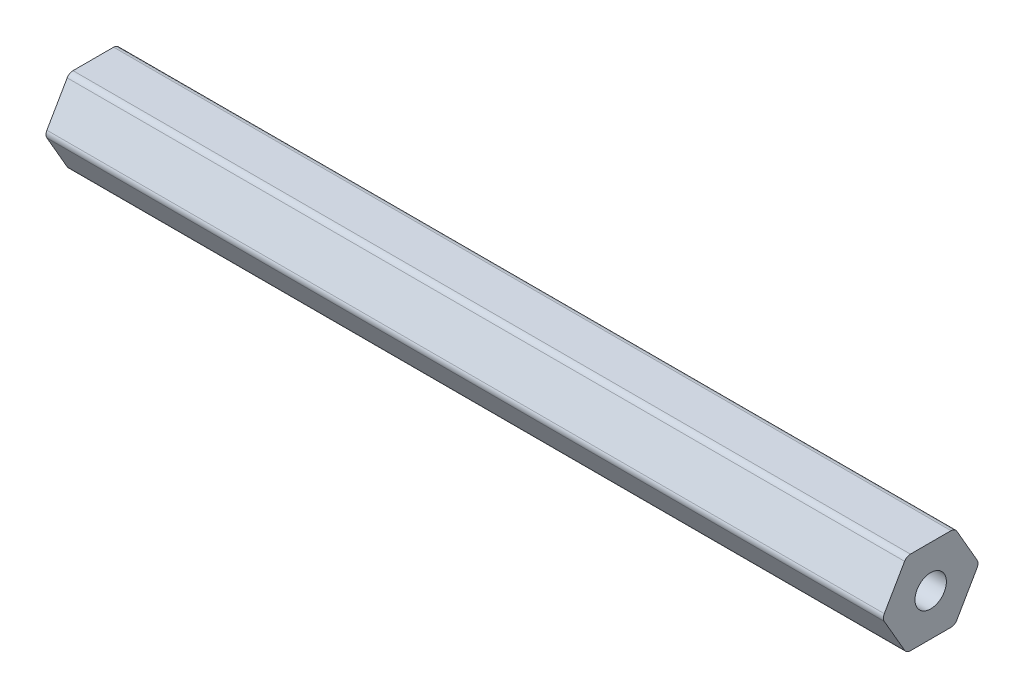
ISO-10303-21;
HEADER;
FILE_DESCRIPTION(('STEP AP214'),'2;1');
FILE_NAME('part.step','',(''),(''),'','','');
FILE_SCHEMA(('AUTOMOTIVE_DESIGN { 1 0 10303 214 1 1 1 1 }'));
ENDSEC;
DATA;
#1=APPLICATION_CONTEXT('core data for automotive mechanical design processes');
#2=APPLICATION_PROTOCOL_DEFINITION('international standard','automotive_design',2000,#1);
#3=PRODUCT_CONTEXT('',#1,'mechanical');
#4=PRODUCT('Part','Part','',(#3));
#5=PRODUCT_RELATED_PRODUCT_CATEGORY('part','',(#4));
#6=PRODUCT_DEFINITION_FORMATION('','',#4);
#7=PRODUCT_DEFINITION_CONTEXT('part definition',#1,'design');
#8=PRODUCT_DEFINITION('design','',#6,#7);
#9=PRODUCT_DEFINITION_SHAPE('','',#8);
#10=(LENGTH_UNIT() NAMED_UNIT(*) SI_UNIT(.MILLI.,.METRE.));
#11=(NAMED_UNIT(*) PLANE_ANGLE_UNIT() SI_UNIT($,.RADIAN.));
#12=(NAMED_UNIT(*) SI_UNIT($,.STERADIAN.) SOLID_ANGLE_UNIT());
#13=UNCERTAINTY_MEASURE_WITH_UNIT(LENGTH_MEASURE(1.E-05),#10,'distance_accuracy_value','');
#14=(GEOMETRIC_REPRESENTATION_CONTEXT(3) GLOBAL_UNCERTAINTY_ASSIGNED_CONTEXT((#13)) GLOBAL_UNIT_ASSIGNED_CONTEXT((#10,
#11,#12)) REPRESENTATION_CONTEXT('',''));
#15=CARTESIAN_POINT('',(0.,0.,0.));
#16=DIRECTION('',(0.,0.,1.));
#17=DIRECTION('',(1.,0.,0.));
#18=AXIS2_PLACEMENT_3D('',#15,#16,#17);
#19=CARTESIAN_POINT('',(127.,5.334,-3.07958633585748));
#20=DIRECTION('',(-1.,0.,0.));
#21=DIRECTION('',(0.,0.,1.));
#22=AXIS2_PLACEMENT_3D('',#19,#20,#21);
#23=PLANE('',#22);
#24=CARTESIAN_POINT('',(127.,5.334,-3.07958633585748));
#25=DIRECTION('',(1.,0.,0.));
#26=DIRECTION('',(0.,0.,1.));
#27=AXIS2_PLACEMENT_3D('',#24,#25,#26);
#28=CIRCLE('',#27,1.016);
#29=CARTESIAN_POINT('',(127.,5.84199999999999,-3.95946814610247));
#30=VERTEX_POINT('',#29);
#31=CARTESIAN_POINT('',(127.,6.34999999999999,-3.07958633585748));
#32=VERTEX_POINT('',#31);
#33=EDGE_CURVE('E206',#30,#32,#28,.T.);
#34=ORIENTED_EDGE('',*,*,#33,.T.);
#35=DIRECTION('',(0.,0.,1.));
#36=VECTOR('',#35,1.);
#37=CARTESIAN_POINT('',(127.,6.34999999999999,-3.07958633585748));
#38=LINE('',#37,#36);
#39=CARTESIAN_POINT('',(127.,6.35000000000001,3.07958633585745));
#40=VERTEX_POINT('',#39);
#41=EDGE_CURVE('E118',#32,#40,#38,.T.);
#42=ORIENTED_EDGE('',*,*,#41,.T.);
#43=CARTESIAN_POINT('',(127.,5.33400000000001,3.07958633585745));
#44=DIRECTION('',(1.,0.,0.));
#45=DIRECTION('',(0.,0.,1.));
#46=AXIS2_PLACEMENT_3D('',#43,#44,#45);
#47=CIRCLE('',#46,1.016);
#48=CARTESIAN_POINT('',(127.,5.84200000000001,3.95946814610244));
#49=VERTEX_POINT('',#48);
#50=EDGE_CURVE('E243',#40,#49,#47,.T.);
#51=ORIENTED_EDGE('',*,*,#50,.T.);
#52=DIRECTION('',(0.,-0.866025403784437,0.500000000000003));
#53=VECTOR('',#52,1.);
#54=CARTESIAN_POINT('',(127.,5.84200000000001,3.95946814610244));
#55=LINE('',#54,#53);
#56=CARTESIAN_POINT('',(127.,0.508000000000022,7.03905448195992));
#57=VERTEX_POINT('',#56);
#58=EDGE_CURVE('E263',#49,#57,#55,.T.);
#59=ORIENTED_EDGE('',*,*,#58,.T.);
#60=CARTESIAN_POINT('',(127.,0.,6.15917267171493));
#61=DIRECTION('',(1.,0.,0.));
#62=DIRECTION('',(0.,0.,1.));
#63=AXIS2_PLACEMENT_3D('',#60,#61,#62);
#64=CIRCLE('',#63,1.016);
#65=CARTESIAN_POINT('',(127.,-0.50799999999998,7.03905448195993));
#66=VERTEX_POINT('',#65);
#67=EDGE_CURVE('E259',#57,#66,#64,.T.);
#68=ORIENTED_EDGE('',*,*,#67,.T.);
#69=DIRECTION('',(0.,-0.86602540378444,-0.499999999999998));
#70=VECTOR('',#69,1.);
#71=CARTESIAN_POINT('',(127.,-0.507999999999979,7.03905448195992));
#72=LINE('',#71,#70);
#73=CARTESIAN_POINT('',(127.,-5.84199999999999,3.95946814610247));
#74=VERTEX_POINT('',#73);
#75=EDGE_CURVE('E262',#66,#74,#72,.T.);
#76=ORIENTED_EDGE('',*,*,#75,.T.);
#77=CARTESIAN_POINT('',(127.,-5.334,3.07958633585748));
#78=DIRECTION('',(1.,0.,0.));
#79=DIRECTION('',(0.,0.,1.));
#80=AXIS2_PLACEMENT_3D('',#77,#78,#79);
#81=CIRCLE('',#80,1.016);
#82=CARTESIAN_POINT('',(127.,-6.35,3.07958633585748));
#83=VERTEX_POINT('',#82);
#84=EDGE_CURVE('E267',#74,#83,#81,.T.);
#85=ORIENTED_EDGE('',*,*,#84,.T.);
#86=DIRECTION('',(0.,0.,-1.));
#87=VECTOR('',#86,1.);
#88=CARTESIAN_POINT('',(127.,-6.35,3.07958633585748));
#89=LINE('',#88,#87);
#90=CARTESIAN_POINT('',(127.,-6.35000000000001,-3.07958633585745));
#91=VERTEX_POINT('',#90);
#92=EDGE_CURVE('E274',#83,#91,#89,.T.);
#93=ORIENTED_EDGE('',*,*,#92,.T.);
#94=CARTESIAN_POINT('',(127.,-5.33400000000001,-3.07958633585745));
#95=DIRECTION('',(1.,0.,0.));
#96=DIRECTION('',(0.,0.,1.));
#97=AXIS2_PLACEMENT_3D('',#94,#95,#96);
#98=CIRCLE('',#97,1.016);
#99=CARTESIAN_POINT('',(127.,-5.84200000000001,-3.95946814610244));
#100=VERTEX_POINT('',#99);
#101=EDGE_CURVE('E149',#91,#100,#98,.T.);
#102=ORIENTED_EDGE('',*,*,#101,.T.);
#103=DIRECTION('',(0.,0.866025403784437,-0.500000000000002));
#104=VECTOR('',#103,1.);
#105=CARTESIAN_POINT('',(127.,-5.84200000000001,-3.95946814610244));
#106=LINE('',#105,#104);
#107=CARTESIAN_POINT('',(127.,-0.508000000000019,-7.03905448195992));
#108=VERTEX_POINT('',#107);
#109=EDGE_CURVE('E143',#100,#108,#106,.T.);
#110=ORIENTED_EDGE('',*,*,#109,.T.);
#111=CARTESIAN_POINT('',(127.,0.,-6.15917267171493));
#112=DIRECTION('',(1.,0.,0.));
#113=DIRECTION('',(0.,0.,1.));
#114=AXIS2_PLACEMENT_3D('',#111,#112,#113);
#115=CIRCLE('',#114,1.016);
#116=CARTESIAN_POINT('',(127.,0.507999999999981,-7.03905448195992));
#117=VERTEX_POINT('',#116);
#118=EDGE_CURVE('E147',#108,#117,#115,.T.);
#119=ORIENTED_EDGE('',*,*,#118,.T.);
#120=DIRECTION('',(0.,0.86602540378444,0.499999999999997));
#121=VECTOR('',#120,1.);
#122=CARTESIAN_POINT('',(127.,0.50799999999998,-7.03905448195992));
#123=LINE('',#122,#121);
#124=EDGE_CURVE('E63',#117,#30,#123,.T.);
#125=ORIENTED_EDGE('',*,*,#124,.T.);
#126=EDGE_LOOP('',(#34,#42,#51,#59,#68,#76,#85,#93,#102,#110,#119,#125));
#127=FACE_BOUND('',#126,.T.);
#128=CARTESIAN_POINT('',(127.,0.,0.));
#129=DIRECTION('',(1.,0.,0.));
#130=DIRECTION('',(0.,0.,-1.));
#131=AXIS2_PLACEMENT_3D('',#128,#129,#130);
#132=CIRCLE('',#131,2.38125);
#133=CARTESIAN_POINT('',(127.,0.,-2.38125));
#134=VERTEX_POINT('',#133);
#135=EDGE_CURVE('E176',#134,#134,#132,.T.);
#136=ORIENTED_EDGE('',*,*,#135,.F.);
#137=EDGE_LOOP('',(#136));
#138=FACE_BOUND('',#137,.T.);
#139=ADVANCED_FACE('F45',(#127,#138),#23,.F.);
#140=CARTESIAN_POINT('',(0.,5.334,-3.07958633585748));
#141=DIRECTION('',(-1.,0.,0.));
#142=DIRECTION('',(0.,0.,1.));
#143=AXIS2_PLACEMENT_3D('',#140,#141,#142);
#144=PLANE('',#143);
#145=CARTESIAN_POINT('',(0.,5.334,-3.07958633585748));
#146=DIRECTION('',(1.,0.,0.));
#147=DIRECTION('',(0.,0.,1.));
#148=AXIS2_PLACEMENT_3D('',#145,#146,#147);
#149=CIRCLE('',#148,1.016);
#150=CARTESIAN_POINT('',(0.,5.84199999999999,-3.95946814610247));
#151=VERTEX_POINT('',#150);
#152=CARTESIAN_POINT('',(0.,6.34999999999999,-3.07958633585748));
#153=VERTEX_POINT('',#152);
#154=EDGE_CURVE('E171',#151,#153,#149,.T.);
#155=ORIENTED_EDGE('',*,*,#154,.F.);
#156=DIRECTION('',(0.,0.86602540378444,0.499999999999997));
#157=VECTOR('',#156,1.);
#158=CARTESIAN_POINT('',(0.,0.50799999999998,-7.03905448195992));
#159=LINE('',#158,#157);
#160=CARTESIAN_POINT('',(0.,0.507999999999981,-7.03905448195992));
#161=VERTEX_POINT('',#160);
#162=EDGE_CURVE('E110',#161,#151,#159,.T.);
#163=ORIENTED_EDGE('',*,*,#162,.F.);
#164=CARTESIAN_POINT('',(0.,0.,-6.15917267171493));
#165=DIRECTION('',(1.,0.,0.));
#166=DIRECTION('',(0.,0.,1.));
#167=AXIS2_PLACEMENT_3D('',#164,#165,#166);
#168=CIRCLE('',#167,1.016);
#169=CARTESIAN_POINT('',(0.,-0.508000000000019,-7.03905448195992));
#170=VERTEX_POINT('',#169);
#171=EDGE_CURVE('E104',#170,#161,#168,.T.);
#172=ORIENTED_EDGE('',*,*,#171,.F.);
#173=DIRECTION('',(0.,0.866025403784437,-0.500000000000002));
#174=VECTOR('',#173,1.);
#175=CARTESIAN_POINT('',(0.,-5.84200000000001,-3.95946814610244));
#176=LINE('',#175,#174);
#177=CARTESIAN_POINT('',(0.,-5.84200000000001,-3.95946814610244));
#178=VERTEX_POINT('',#177);
#179=EDGE_CURVE('E158',#178,#170,#176,.T.);
#180=ORIENTED_EDGE('',*,*,#179,.F.);
#181=CARTESIAN_POINT('',(0.,-5.33400000000001,-3.07958633585745));
#182=DIRECTION('',(1.,0.,0.));
#183=DIRECTION('',(0.,0.,1.));
#184=AXIS2_PLACEMENT_3D('',#181,#182,#183);
#185=CIRCLE('',#184,1.016);
#186=CARTESIAN_POINT('',(0.,-6.35000000000001,-3.07958633585745));
#187=VERTEX_POINT('',#186);
#188=EDGE_CURVE('E197',#187,#178,#185,.T.);
#189=ORIENTED_EDGE('',*,*,#188,.F.);
#190=DIRECTION('',(0.,0.,-1.));
#191=VECTOR('',#190,1.);
#192=CARTESIAN_POINT('',(0.,-6.35,3.07958633585748));
#193=LINE('',#192,#191);
#194=CARTESIAN_POINT('',(0.,-6.35,3.07958633585748));
#195=VERTEX_POINT('',#194);
#196=EDGE_CURVE('E194',#195,#187,#193,.T.);
#197=ORIENTED_EDGE('',*,*,#196,.F.);
#198=CARTESIAN_POINT('',(0.,-5.334,3.07958633585748));
#199=DIRECTION('',(1.,0.,0.));
#200=DIRECTION('',(0.,0.,1.));
#201=AXIS2_PLACEMENT_3D('',#198,#199,#200);
#202=CIRCLE('',#201,1.016);
#203=CARTESIAN_POINT('',(0.,-5.84199999999999,3.95946814610247));
#204=VERTEX_POINT('',#203);
#205=EDGE_CURVE('E191',#204,#195,#202,.T.);
#206=ORIENTED_EDGE('',*,*,#205,.F.);
#207=DIRECTION('',(0.,-0.86602540378444,-0.499999999999998));
#208=VECTOR('',#207,1.);
#209=CARTESIAN_POINT('',(0.,-0.507999999999979,7.03905448195992));
#210=LINE('',#209,#208);
#211=CARTESIAN_POINT('',(0.,-0.50799999999998,7.03905448195993));
#212=VERTEX_POINT('',#211);
#213=EDGE_CURVE('E188',#212,#204,#210,.T.);
#214=ORIENTED_EDGE('',*,*,#213,.F.);
#215=CARTESIAN_POINT('',(0.,0.,6.15917267171493));
#216=DIRECTION('',(1.,0.,0.));
#217=DIRECTION('',(0.,0.,1.));
#218=AXIS2_PLACEMENT_3D('',#215,#216,#217);
#219=CIRCLE('',#218,1.016);
#220=CARTESIAN_POINT('',(0.,0.508000000000022,7.03905448195992));
#221=VERTEX_POINT('',#220);
#222=EDGE_CURVE('E185',#221,#212,#219,.T.);
#223=ORIENTED_EDGE('',*,*,#222,.F.);
#224=DIRECTION('',(0.,-0.866025403784437,0.500000000000003));
#225=VECTOR('',#224,1.);
#226=CARTESIAN_POINT('',(0.,5.84200000000001,3.95946814610244));
#227=LINE('',#226,#225);
#228=CARTESIAN_POINT('',(0.,5.84200000000001,3.95946814610244));
#229=VERTEX_POINT('',#228);
#230=EDGE_CURVE('E182',#229,#221,#227,.T.);
#231=ORIENTED_EDGE('',*,*,#230,.F.);
#232=CARTESIAN_POINT('',(0.,5.33400000000001,3.07958633585745));
#233=DIRECTION('',(1.,0.,0.));
#234=DIRECTION('',(0.,0.,1.));
#235=AXIS2_PLACEMENT_3D('',#232,#233,#234);
#236=CIRCLE('',#235,1.016);
#237=CARTESIAN_POINT('',(0.,6.35000000000001,3.07958633585745));
#238=VERTEX_POINT('',#237);
#239=EDGE_CURVE('E179',#238,#229,#236,.T.);
#240=ORIENTED_EDGE('',*,*,#239,.F.);
#241=DIRECTION('',(0.,0.,1.));
#242=VECTOR('',#241,1.);
#243=CARTESIAN_POINT('',(0.,6.34999999999999,-3.07958633585748));
#244=LINE('',#243,#242);
#245=EDGE_CURVE('E175',#153,#238,#244,.T.);
#246=ORIENTED_EDGE('',*,*,#245,.F.);
#247=EDGE_LOOP('',(#155,#163,#172,#180,#189,#197,#206,#214,#223,#231,#240,#246));
#248=FACE_BOUND('',#247,.T.);
#249=CARTESIAN_POINT('',(0.,0.,0.));
#250=DIRECTION('',(1.,0.,0.));
#251=DIRECTION('',(0.,0.,-1.));
#252=AXIS2_PLACEMENT_3D('',#249,#250,#251);
#253=CIRCLE('',#252,2.38125);
#254=CARTESIAN_POINT('',(0.,0.,-2.38125));
#255=VERTEX_POINT('',#254);
#256=EDGE_CURVE('E474',#255,#255,#253,.T.);
#257=ORIENTED_EDGE('',*,*,#256,.T.);
#258=EDGE_LOOP('',(#257));
#259=FACE_BOUND('',#258,.T.);
#260=ADVANCED_FACE('F247',(#248,#259),#144,.T.);
#261=CARTESIAN_POINT('',(127.,5.334,-3.07958633585748));
#262=DIRECTION('',(-1.,0.,0.));
#263=DIRECTION('',(0.,0.,1.));
#264=AXIS2_PLACEMENT_3D('',#261,#262,#263);
#265=CYLINDRICAL_SURFACE('',#264,1.016);
#266=ORIENTED_EDGE('',*,*,#154,.T.);
#267=DIRECTION('',(-1.,0.,0.));
#268=VECTOR('',#267,1.);
#269=CARTESIAN_POINT('',(127.,6.34999999999999,-3.07958633585748));
#270=LINE('',#269,#268);
#271=EDGE_CURVE('E11',#32,#153,#270,.T.);
#272=ORIENTED_EDGE('',*,*,#271,.F.);
#273=ORIENTED_EDGE('',*,*,#33,.F.);
#274=DIRECTION('',(-1.,0.,0.));
#275=VECTOR('',#274,1.);
#276=CARTESIAN_POINT('',(127.,5.84199999999999,-3.95946814610247));
#277=LINE('',#276,#275);
#278=EDGE_CURVE('E167',#30,#151,#277,.T.);
#279=ORIENTED_EDGE('',*,*,#278,.T.);
#280=EDGE_LOOP('',(#266,#272,#273,#279));
#281=FACE_BOUND('',#280,.T.);
#282=ADVANCED_FACE('F47',(#281),#265,.T.);
#283=CARTESIAN_POINT('',(127.,6.34999999999999,-3.07958633585748));
#284=DIRECTION('',(0.,-1.,0.));
#285=DIRECTION('',(0.,0.,-1.));
#286=AXIS2_PLACEMENT_3D('',#283,#284,#285);
#287=PLANE('',#286);
#288=ORIENTED_EDGE('',*,*,#245,.T.);
#289=DIRECTION('',(-1.,0.,0.));
#290=VECTOR('',#289,1.);
#291=CARTESIAN_POINT('',(127.,6.35000000000001,3.07958633585745));
#292=LINE('',#291,#290);
#293=EDGE_CURVE('E55',#40,#238,#292,.T.);
#294=ORIENTED_EDGE('',*,*,#293,.F.);
#295=ORIENTED_EDGE('',*,*,#41,.F.);
#296=ORIENTED_EDGE('',*,*,#271,.T.);
#297=EDGE_LOOP('',(#288,#294,#295,#296));
#298=FACE_BOUND('',#297,.T.);
#299=ADVANCED_FACE('F310',(#298),#287,.F.);
#300=CARTESIAN_POINT('',(127.,5.33400000000001,3.07958633585745));
#301=DIRECTION('',(-1.,0.,0.));
#302=DIRECTION('',(0.,0.,1.));
#303=AXIS2_PLACEMENT_3D('',#300,#301,#302);
#304=CYLINDRICAL_SURFACE('',#303,1.016);
#305=ORIENTED_EDGE('',*,*,#239,.T.);
#306=DIRECTION('',(-1.,0.,0.));
#307=VECTOR('',#306,1.);
#308=CARTESIAN_POINT('',(127.,5.84200000000001,3.95946814610244));
#309=LINE('',#308,#307);
#310=EDGE_CURVE('E233',#49,#229,#309,.T.);
#311=ORIENTED_EDGE('',*,*,#310,.F.);
#312=ORIENTED_EDGE('',*,*,#50,.F.);
#313=ORIENTED_EDGE('',*,*,#293,.T.);
#314=EDGE_LOOP('',(#305,#311,#312,#313));
#315=FACE_BOUND('',#314,.T.);
#316=ADVANCED_FACE('F241',(#315),#304,.T.);
#317=CARTESIAN_POINT('',(127.,5.84200000000001,3.95946814610244));
#318=DIRECTION('',(0.,-0.500000000000003,-0.866025403784437));
#319=DIRECTION('',(0.,0.866025403784437,-0.500000000000003));
#320=AXIS2_PLACEMENT_3D('',#317,#318,#319);
#321=PLANE('',#320);
#322=ORIENTED_EDGE('',*,*,#230,.T.);
#323=DIRECTION('',(-1.,0.,0.));
#324=VECTOR('',#323,1.);
#325=CARTESIAN_POINT('',(127.,0.508000000000022,7.03905448195992));
#326=LINE('',#325,#324);
#327=EDGE_CURVE('E229',#57,#221,#326,.T.);
#328=ORIENTED_EDGE('',*,*,#327,.F.);
#329=ORIENTED_EDGE('',*,*,#58,.F.);
#330=ORIENTED_EDGE('',*,*,#310,.T.);
#331=EDGE_LOOP('',(#322,#328,#329,#330));
#332=FACE_BOUND('',#331,.T.);
#333=ADVANCED_FACE('F253',(#332),#321,.F.);
#334=CARTESIAN_POINT('',(127.,0.,6.15917267171493));
#335=DIRECTION('',(-1.,0.,0.));
#336=DIRECTION('',(0.,0.,1.));
#337=AXIS2_PLACEMENT_3D('',#334,#335,#336);
#338=CYLINDRICAL_SURFACE('',#337,1.016);
#339=ORIENTED_EDGE('',*,*,#222,.T.);
#340=DIRECTION('',(-1.,0.,0.));
#341=VECTOR('',#340,1.);
#342=CARTESIAN_POINT('',(127.,-0.50799999999998,7.03905448195993));
#343=LINE('',#342,#341);
#344=EDGE_CURVE('E225',#66,#212,#343,.T.);
#345=ORIENTED_EDGE('',*,*,#344,.F.);
#346=ORIENTED_EDGE('',*,*,#67,.F.);
#347=ORIENTED_EDGE('',*,*,#327,.T.);
#348=EDGE_LOOP('',(#339,#345,#346,#347));
#349=FACE_BOUND('',#348,.T.);
#350=ADVANCED_FACE('F257',(#349),#338,.T.);
#351=CARTESIAN_POINT('',(127.,-0.507999999999979,7.03905448195992));
#352=DIRECTION('',(0.,0.499999999999998,-0.86602540378444));
#353=DIRECTION('',(0.,0.86602540378444,0.499999999999998));
#354=AXIS2_PLACEMENT_3D('',#351,#352,#353);
#355=PLANE('',#354);
#356=ORIENTED_EDGE('',*,*,#213,.T.);
#357=DIRECTION('',(-1.,0.,0.));
#358=VECTOR('',#357,1.);
#359=CARTESIAN_POINT('',(127.,-5.84199999999999,3.95946814610247));
#360=LINE('',#359,#358);
#361=EDGE_CURVE('E221',#74,#204,#360,.T.);
#362=ORIENTED_EDGE('',*,*,#361,.F.);
#363=ORIENTED_EDGE('',*,*,#75,.F.);
#364=ORIENTED_EDGE('',*,*,#344,.T.);
#365=EDGE_LOOP('',(#356,#362,#363,#364));
#366=FACE_BOUND('',#365,.T.);
#367=ADVANCED_FACE('F323',(#366),#355,.F.);
#368=CARTESIAN_POINT('',(127.,-5.334,3.07958633585748));
#369=DIRECTION('',(-1.,0.,0.));
#370=DIRECTION('',(0.,0.,1.));
#371=AXIS2_PLACEMENT_3D('',#368,#369,#370);
#372=CYLINDRICAL_SURFACE('',#371,1.016);
#373=ORIENTED_EDGE('',*,*,#205,.T.);
#374=DIRECTION('',(-1.,0.,0.));
#375=VECTOR('',#374,1.);
#376=CARTESIAN_POINT('',(127.,-6.35,3.07958633585748));
#377=LINE('',#376,#375);
#378=EDGE_CURVE('E217',#83,#195,#377,.T.);
#379=ORIENTED_EDGE('',*,*,#378,.F.);
#380=ORIENTED_EDGE('',*,*,#84,.F.);
#381=ORIENTED_EDGE('',*,*,#361,.T.);
#382=EDGE_LOOP('',(#373,#379,#380,#381));
#383=FACE_BOUND('',#382,.T.);
#384=ADVANCED_FACE('F326',(#383),#372,.T.);
#385=CARTESIAN_POINT('',(127.,-6.35,3.07958633585748));
#386=DIRECTION('',(0.,1.,0.));
#387=DIRECTION('',(0.,0.,1.));
#388=AXIS2_PLACEMENT_3D('',#385,#386,#387);
#389=PLANE('',#388);
#390=ORIENTED_EDGE('',*,*,#196,.T.);
#391=DIRECTION('',(-1.,0.,0.));
#392=VECTOR('',#391,1.);
#393=CARTESIAN_POINT('',(127.,-6.35000000000001,-3.07958633585745));
#394=LINE('',#393,#392);
#395=EDGE_CURVE('E213',#91,#187,#394,.T.);
#396=ORIENTED_EDGE('',*,*,#395,.F.);
#397=ORIENTED_EDGE('',*,*,#92,.F.);
#398=ORIENTED_EDGE('',*,*,#378,.T.);
#399=EDGE_LOOP('',(#390,#396,#397,#398));
#400=FACE_BOUND('',#399,.T.);
#401=ADVANCED_FACE('F282',(#400),#389,.F.);
#402=CARTESIAN_POINT('',(127.,-5.33400000000001,-3.07958633585745));
#403=DIRECTION('',(-1.,0.,0.));
#404=DIRECTION('',(0.,0.,1.));
#405=AXIS2_PLACEMENT_3D('',#402,#403,#404);
#406=CYLINDRICAL_SURFACE('',#405,1.016);
#407=ORIENTED_EDGE('',*,*,#188,.T.);
#408=DIRECTION('',(-1.,0.,0.));
#409=VECTOR('',#408,1.);
#410=CARTESIAN_POINT('',(127.,-5.84200000000001,-3.95946814610244));
#411=LINE('',#410,#409);
#412=EDGE_CURVE('E160',#100,#178,#411,.T.);
#413=ORIENTED_EDGE('',*,*,#412,.F.);
#414=ORIENTED_EDGE('',*,*,#101,.F.);
#415=ORIENTED_EDGE('',*,*,#395,.T.);
#416=EDGE_LOOP('',(#407,#413,#414,#415));
#417=FACE_BOUND('',#416,.T.);
#418=ADVANCED_FACE('F286',(#417),#406,.T.);
#419=CARTESIAN_POINT('',(127.,-5.84200000000001,-3.95946814610244));
#420=DIRECTION('',(0.,0.500000000000002,0.866025403784437));
#421=DIRECTION('',(0.,-0.866025403784437,0.500000000000002));
#422=AXIS2_PLACEMENT_3D('',#419,#420,#421);
#423=PLANE('',#422);
#424=ORIENTED_EDGE('',*,*,#179,.T.);
#425=DIRECTION('',(-1.,0.,0.));
#426=VECTOR('',#425,1.);
#427=CARTESIAN_POINT('',(127.,-0.508000000000019,-7.03905448195992));
#428=LINE('',#427,#426);
#429=EDGE_CURVE('E155',#108,#170,#428,.T.);
#430=ORIENTED_EDGE('',*,*,#429,.F.);
#431=ORIENTED_EDGE('',*,*,#109,.F.);
#432=ORIENTED_EDGE('',*,*,#412,.T.);
#433=EDGE_LOOP('',(#424,#430,#431,#432));
#434=FACE_BOUND('',#433,.T.);
#435=ADVANCED_FACE('F156',(#434),#423,.F.);
#436=CARTESIAN_POINT('',(127.,0.,-6.15917267171493));
#437=DIRECTION('',(-1.,0.,0.));
#438=DIRECTION('',(0.,0.,1.));
#439=AXIS2_PLACEMENT_3D('',#436,#437,#438);
#440=CYLINDRICAL_SURFACE('',#439,1.016);
#441=ORIENTED_EDGE('',*,*,#171,.T.);
#442=DIRECTION('',(-1.,0.,0.));
#443=VECTOR('',#442,1.);
#444=CARTESIAN_POINT('',(127.,0.507999999999981,-7.03905448195992));
#445=LINE('',#444,#443);
#446=EDGE_CURVE('E161',#117,#161,#445,.T.);
#447=ORIENTED_EDGE('',*,*,#446,.F.);
#448=ORIENTED_EDGE('',*,*,#118,.F.);
#449=ORIENTED_EDGE('',*,*,#429,.T.);
#450=EDGE_LOOP('',(#441,#447,#448,#449));
#451=FACE_BOUND('',#450,.T.);
#452=ADVANCED_FACE('F163',(#451),#440,.T.);
#453=CARTESIAN_POINT('',(127.,0.50799999999998,-7.03905448195992));
#454=DIRECTION('',(0.,-0.499999999999997,0.86602540378444));
#455=DIRECTION('',(0.,-0.86602540378444,-0.499999999999997));
#456=AXIS2_PLACEMENT_3D('',#453,#454,#455);
#457=PLANE('',#456);
#458=ORIENTED_EDGE('',*,*,#162,.T.);
#459=ORIENTED_EDGE('',*,*,#278,.F.);
#460=ORIENTED_EDGE('',*,*,#124,.F.);
#461=ORIENTED_EDGE('',*,*,#446,.T.);
#462=EDGE_LOOP('',(#458,#459,#460,#461));
#463=FACE_BOUND('',#462,.T.);
#464=ADVANCED_FACE('F290',(#463),#457,.F.);
#465=CARTESIAN_POINT('',(127.,0.,0.));
#466=DIRECTION('',(-1.,0.,0.));
#467=DIRECTION('',(0.,0.,1.));
#468=AXIS2_PLACEMENT_3D('',#465,#466,#467);
#469=CYLINDRICAL_SURFACE('',#468,2.38125);
#470=ORIENTED_EDGE('',*,*,#135,.T.);
#471=EDGE_LOOP('',(#470));
#472=FACE_BOUND('',#471,.T.);
#473=ORIENTED_EDGE('',*,*,#256,.F.);
#474=EDGE_LOOP('',(#473));
#475=FACE_BOUND('',#474,.T.);
#476=ADVANCED_FACE('F292',(#472,#475),#469,.F.);
#477=CLOSED_SHELL('',(#139,#260,#282,#299,#316,#333,#350,#367,#384,#401,#418,#435,#452,#464,#476));
#478=MANIFOLD_SOLID_BREP('B2',#477);
#479=ADVANCED_BREP_SHAPE_REPRESENTATION('',(#18,#478),#14);
#480=SHAPE_DEFINITION_REPRESENTATION(#9,#479);
ENDSEC;
END-ISO-10303-21;
